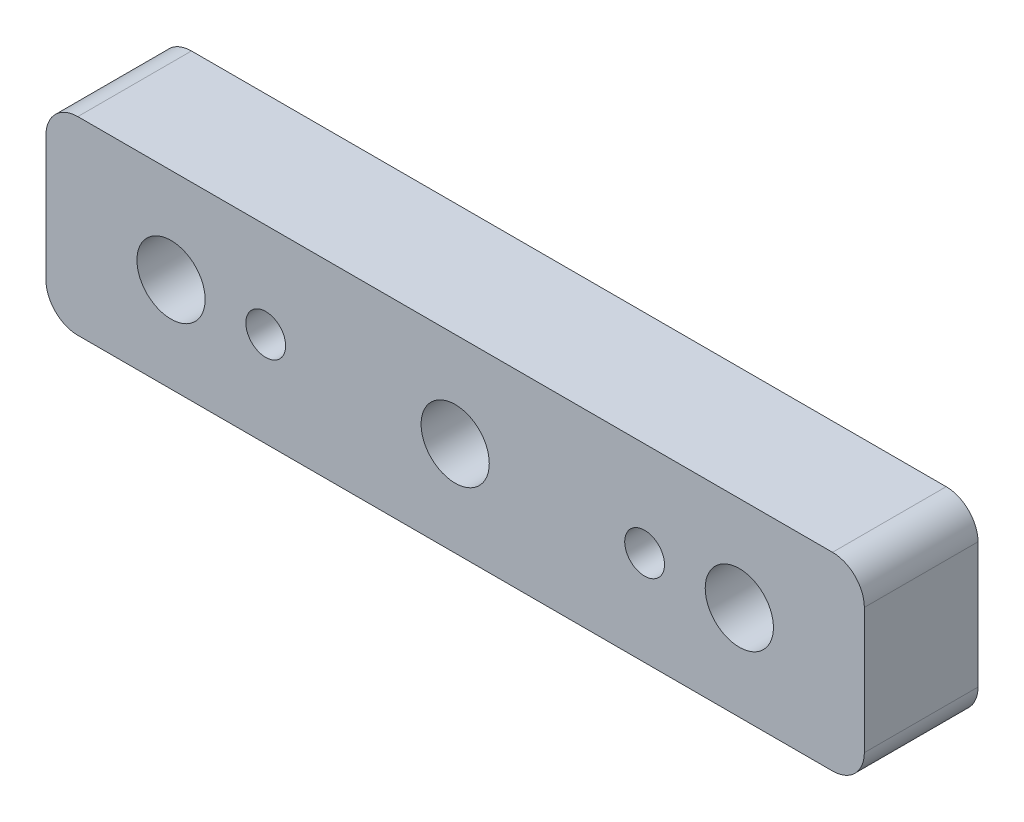
ISO-10303-21;
HEADER;
FILE_DESCRIPTION(('STEP AP214'),'2;1');
FILE_NAME('part.step','',(''),(''),'','','');
FILE_SCHEMA(('AUTOMOTIVE_DESIGN { 1 0 10303 214 1 1 1 1 }'));
ENDSEC;
DATA;
#1=APPLICATION_CONTEXT('core data for automotive mechanical design processes');
#2=APPLICATION_PROTOCOL_DEFINITION('international standard','automotive_design',2000,#1);
#3=PRODUCT_CONTEXT('',#1,'mechanical');
#4=PRODUCT('Part','Part','',(#3));
#5=PRODUCT_RELATED_PRODUCT_CATEGORY('part','',(#4));
#6=PRODUCT_DEFINITION_FORMATION('','',#4);
#7=PRODUCT_DEFINITION_CONTEXT('part definition',#1,'design');
#8=PRODUCT_DEFINITION('design','',#6,#7);
#9=PRODUCT_DEFINITION_SHAPE('','',#8);
#10=(LENGTH_UNIT() NAMED_UNIT(*) SI_UNIT(.MILLI.,.METRE.));
#11=(NAMED_UNIT(*) PLANE_ANGLE_UNIT() SI_UNIT($,.RADIAN.));
#12=(NAMED_UNIT(*) SI_UNIT($,.STERADIAN.) SOLID_ANGLE_UNIT());
#13=UNCERTAINTY_MEASURE_WITH_UNIT(LENGTH_MEASURE(1.E-05),#10,'distance_accuracy_value','');
#14=(GEOMETRIC_REPRESENTATION_CONTEXT(3) GLOBAL_UNCERTAINTY_ASSIGNED_CONTEXT((#13)) GLOBAL_UNIT_ASSIGNED_CONTEXT((#10,
#11,#12)) REPRESENTATION_CONTEXT('',''));
#15=CARTESIAN_POINT('',(0.,0.,0.));
#16=DIRECTION('',(0.,0.,1.));
#17=DIRECTION('',(1.,0.,0.));
#18=AXIS2_PLACEMENT_3D('',#15,#16,#17);
#19=CARTESIAN_POINT('',(39.84,6.64000000000001,12.));
#20=DIRECTION('',(0.,0.,-1.));
#21=DIRECTION('',(-1.,0.,0.));
#22=AXIS2_PLACEMENT_3D('',#19,#20,#21);
#23=CYLINDRICAL_SURFACE('',#22,3.36);
#24=CARTESIAN_POINT('',(39.84,6.64000000000001,0.));
#25=DIRECTION('',(0.,0.,1.));
#26=DIRECTION('',(1.,0.,0.));
#27=AXIS2_PLACEMENT_3D('',#24,#25,#26);
#28=CIRCLE('',#27,3.36);
#29=CARTESIAN_POINT('',(43.2,6.64000000000001,0.));
#30=VERTEX_POINT('',#29);
#31=CARTESIAN_POINT('',(39.84,10.,0.));
#32=VERTEX_POINT('',#31);
#33=EDGE_CURVE('E131',#30,#32,#28,.T.);
#34=ORIENTED_EDGE('',*,*,#33,.T.);
#35=DIRECTION('',(0.,0.,-1.));
#36=VECTOR('',#35,1.);
#37=CARTESIAN_POINT('',(39.84,10.,12.));
#38=LINE('',#37,#36);
#39=CARTESIAN_POINT('',(39.84,10.,12.));
#40=VERTEX_POINT('',#39);
#41=EDGE_CURVE('E11',#40,#32,#38,.T.);
#42=ORIENTED_EDGE('',*,*,#41,.F.);
#43=CARTESIAN_POINT('',(39.84,6.64000000000001,12.));
#44=DIRECTION('',(0.,0.,1.));
#45=DIRECTION('',(1.,0.,0.));
#46=AXIS2_PLACEMENT_3D('',#43,#44,#45);
#47=CIRCLE('',#46,3.36);
#48=CARTESIAN_POINT('',(43.2,6.64000000000001,12.));
#49=VERTEX_POINT('',#48);
#50=EDGE_CURVE('E146',#49,#40,#47,.T.);
#51=ORIENTED_EDGE('',*,*,#50,.F.);
#52=DIRECTION('',(0.,0.,-1.));
#53=VECTOR('',#52,1.);
#54=CARTESIAN_POINT('',(43.2,6.64000000000001,12.));
#55=LINE('',#54,#53);
#56=EDGE_CURVE('E127',#49,#30,#55,.T.);
#57=ORIENTED_EDGE('',*,*,#56,.T.);
#58=EDGE_LOOP('',(#34,#42,#51,#57));
#59=FACE_BOUND('',#58,.T.);
#60=ADVANCED_FACE('F35',(#59),#23,.T.);
#61=CARTESIAN_POINT('',(39.84,10.,12.));
#62=DIRECTION('',(0.,-1.,0.));
#63=DIRECTION('',(1.,0.,0.));
#64=AXIS2_PLACEMENT_3D('',#61,#62,#63);
#65=PLANE('',#64);
#66=DIRECTION('',(-1.,0.,0.));
#67=VECTOR('',#66,1.);
#68=CARTESIAN_POINT('',(39.84,10.,0.));
#69=LINE('',#68,#67);
#70=CARTESIAN_POINT('',(-39.84,9.99999999999999,0.));
#71=VERTEX_POINT('',#70);
#72=EDGE_CURVE('E134',#32,#71,#69,.T.);
#73=ORIENTED_EDGE('',*,*,#72,.T.);
#74=DIRECTION('',(0.,0.,-1.));
#75=VECTOR('',#74,1.);
#76=CARTESIAN_POINT('',(-39.84,9.99999999999999,12.));
#77=LINE('',#76,#75);
#78=CARTESIAN_POINT('',(-39.84,9.99999999999999,12.));
#79=VERTEX_POINT('',#78);
#80=EDGE_CURVE('E43',#79,#71,#77,.T.);
#81=ORIENTED_EDGE('',*,*,#80,.F.);
#82=DIRECTION('',(-1.,0.,0.));
#83=VECTOR('',#82,1.);
#84=CARTESIAN_POINT('',(39.84,10.,12.));
#85=LINE('',#84,#83);
#86=EDGE_CURVE('E94',#40,#79,#85,.T.);
#87=ORIENTED_EDGE('',*,*,#86,.F.);
#88=ORIENTED_EDGE('',*,*,#41,.T.);
#89=EDGE_LOOP('',(#73,#81,#87,#88));
#90=FACE_BOUND('',#89,.T.);
#91=ADVANCED_FACE('F239',(#90),#65,.F.);
#92=CARTESIAN_POINT('',(-39.84,6.64,12.));
#93=DIRECTION('',(0.,0.,-1.));
#94=DIRECTION('',(-1.,0.,0.));
#95=AXIS2_PLACEMENT_3D('',#92,#93,#94);
#96=CYLINDRICAL_SURFACE('',#95,3.36);
#97=CARTESIAN_POINT('',(-39.84,6.64,0.));
#98=DIRECTION('',(0.,0.,1.));
#99=DIRECTION('',(1.,0.,0.));
#100=AXIS2_PLACEMENT_3D('',#97,#98,#99);
#101=CIRCLE('',#100,3.36);
#102=CARTESIAN_POINT('',(-43.2,6.64,0.));
#103=VERTEX_POINT('',#102);
#104=EDGE_CURVE('E137',#71,#103,#101,.T.);
#105=ORIENTED_EDGE('',*,*,#104,.T.);
#106=DIRECTION('',(0.,0.,-1.));
#107=VECTOR('',#106,1.);
#108=CARTESIAN_POINT('',(-43.2,6.64,12.));
#109=LINE('',#108,#107);
#110=CARTESIAN_POINT('',(-43.2,6.64,12.));
#111=VERTEX_POINT('',#110);
#112=EDGE_CURVE('E153',#111,#103,#109,.T.);
#113=ORIENTED_EDGE('',*,*,#112,.F.);
#114=CARTESIAN_POINT('',(-39.84,6.64,12.));
#115=DIRECTION('',(0.,0.,1.));
#116=DIRECTION('',(1.,0.,0.));
#117=AXIS2_PLACEMENT_3D('',#114,#115,#116);
#118=CIRCLE('',#117,3.36);
#119=EDGE_CURVE('E161',#79,#111,#118,.T.);
#120=ORIENTED_EDGE('',*,*,#119,.F.);
#121=ORIENTED_EDGE('',*,*,#80,.T.);
#122=EDGE_LOOP('',(#105,#113,#120,#121));
#123=FACE_BOUND('',#122,.T.);
#124=ADVANCED_FACE('F159',(#123),#96,.T.);
#125=CARTESIAN_POINT('',(-43.2,-6.64,12.));
#126=DIRECTION('',(1.,0.,0.));
#127=DIRECTION('',(0.,0.,-1.));
#128=AXIS2_PLACEMENT_3D('',#125,#126,#127);
#129=PLANE('',#128);
#130=DIRECTION('',(0.,-1.,0.));
#131=VECTOR('',#130,1.);
#132=CARTESIAN_POINT('',(-43.2,-6.64,0.));
#133=LINE('',#132,#131);
#134=CARTESIAN_POINT('',(-43.2,-6.64,0.));
#135=VERTEX_POINT('',#134);
#136=EDGE_CURVE('E139',#103,#135,#133,.T.);
#137=ORIENTED_EDGE('',*,*,#136,.T.);
#138=DIRECTION('',(0.,0.,-1.));
#139=VECTOR('',#138,1.);
#140=CARTESIAN_POINT('',(-43.2,-6.64,12.));
#141=LINE('',#140,#139);
#142=CARTESIAN_POINT('',(-43.2,-6.64,12.));
#143=VERTEX_POINT('',#142);
#144=EDGE_CURVE('E150',#143,#135,#141,.T.);
#145=ORIENTED_EDGE('',*,*,#144,.F.);
#146=DIRECTION('',(0.,-1.,0.));
#147=VECTOR('',#146,1.);
#148=CARTESIAN_POINT('',(-43.2,-6.64,12.));
#149=LINE('',#148,#147);
#150=EDGE_CURVE('E173',#111,#143,#149,.T.);
#151=ORIENTED_EDGE('',*,*,#150,.F.);
#152=ORIENTED_EDGE('',*,*,#112,.T.);
#153=EDGE_LOOP('',(#137,#145,#151,#152));
#154=FACE_BOUND('',#153,.T.);
#155=ADVANCED_FACE('F169',(#154),#129,.F.);
#156=CARTESIAN_POINT('',(-39.84,-6.64,12.));
#157=DIRECTION('',(0.,0.,-1.));
#158=DIRECTION('',(-1.,0.,0.));
#159=AXIS2_PLACEMENT_3D('',#156,#157,#158);
#160=CYLINDRICAL_SURFACE('',#159,3.36);
#161=CARTESIAN_POINT('',(-39.84,-6.64,0.));
#162=DIRECTION('',(0.,0.,1.));
#163=DIRECTION('',(-1.,0.,0.));
#164=AXIS2_PLACEMENT_3D('',#161,#162,#163);
#165=CIRCLE('',#164,3.36);
#166=CARTESIAN_POINT('',(-39.84,-10.,0.));
#167=VERTEX_POINT('',#166);
#168=EDGE_CURVE('E141',#135,#167,#165,.T.);
#169=ORIENTED_EDGE('',*,*,#168,.T.);
#170=DIRECTION('',(0.,0.,-1.));
#171=VECTOR('',#170,1.);
#172=CARTESIAN_POINT('',(-39.84,-10.,12.));
#173=LINE('',#172,#171);
#174=CARTESIAN_POINT('',(-39.84,-10.,12.));
#175=VERTEX_POINT('',#174);
#176=EDGE_CURVE('E122',#175,#167,#173,.T.);
#177=ORIENTED_EDGE('',*,*,#176,.F.);
#178=CARTESIAN_POINT('',(-39.84,-6.64,12.));
#179=DIRECTION('',(0.,0.,1.));
#180=DIRECTION('',(-1.,0.,0.));
#181=AXIS2_PLACEMENT_3D('',#178,#179,#180);
#182=CIRCLE('',#181,3.36);
#183=EDGE_CURVE('E113',#143,#175,#182,.T.);
#184=ORIENTED_EDGE('',*,*,#183,.F.);
#185=ORIENTED_EDGE('',*,*,#144,.T.);
#186=EDGE_LOOP('',(#169,#177,#184,#185));
#187=FACE_BOUND('',#186,.T.);
#188=ADVANCED_FACE('F172',(#187),#160,.T.);
#189=CARTESIAN_POINT('',(39.84,-9.99999999999999,12.));
#190=DIRECTION('',(0.,1.,0.));
#191=DIRECTION('',(-1.,0.,0.));
#192=AXIS2_PLACEMENT_3D('',#189,#190,#191);
#193=PLANE('',#192);
#194=DIRECTION('',(1.,0.,0.));
#195=VECTOR('',#194,1.);
#196=CARTESIAN_POINT('',(39.84,-9.99999999999999,0.));
#197=LINE('',#196,#195);
#198=CARTESIAN_POINT('',(39.84,-9.99999999999999,0.));
#199=VERTEX_POINT('',#198);
#200=EDGE_CURVE('E121',#167,#199,#197,.T.);
#201=ORIENTED_EDGE('',*,*,#200,.T.);
#202=DIRECTION('',(0.,0.,-1.));
#203=VECTOR('',#202,1.);
#204=CARTESIAN_POINT('',(39.84,-9.99999999999999,12.));
#205=LINE('',#204,#203);
#206=CARTESIAN_POINT('',(39.84,-9.99999999999999,12.));
#207=VERTEX_POINT('',#206);
#208=EDGE_CURVE('E118',#207,#199,#205,.T.);
#209=ORIENTED_EDGE('',*,*,#208,.F.);
#210=DIRECTION('',(1.,0.,0.));
#211=VECTOR('',#210,1.);
#212=CARTESIAN_POINT('',(39.84,-9.99999999999999,12.));
#213=LINE('',#212,#211);
#214=EDGE_CURVE('E107',#175,#207,#213,.T.);
#215=ORIENTED_EDGE('',*,*,#214,.F.);
#216=ORIENTED_EDGE('',*,*,#176,.T.);
#217=EDGE_LOOP('',(#201,#209,#215,#216));
#218=FACE_BOUND('',#217,.T.);
#219=ADVANCED_FACE('F119',(#218),#193,.F.);
#220=CARTESIAN_POINT('',(39.84,-6.64,12.));
#221=DIRECTION('',(0.,0.,-1.));
#222=DIRECTION('',(-1.,0.,0.));
#223=AXIS2_PLACEMENT_3D('',#220,#221,#222);
#224=CYLINDRICAL_SURFACE('',#223,3.36);
#225=CARTESIAN_POINT('',(39.84,-6.64,0.));
#226=DIRECTION('',(0.,0.,1.));
#227=DIRECTION('',(1.,0.,0.));
#228=AXIS2_PLACEMENT_3D('',#225,#226,#227);
#229=CIRCLE('',#228,3.36);
#230=CARTESIAN_POINT('',(43.2,-6.64,0.));
#231=VERTEX_POINT('',#230);
#232=EDGE_CURVE('E80',#199,#231,#229,.T.);
#233=ORIENTED_EDGE('',*,*,#232,.T.);
#234=DIRECTION('',(0.,0.,-1.));
#235=VECTOR('',#234,1.);
#236=CARTESIAN_POINT('',(43.2,-6.64,12.));
#237=LINE('',#236,#235);
#238=CARTESIAN_POINT('',(43.2,-6.64,12.));
#239=VERTEX_POINT('',#238);
#240=EDGE_CURVE('E123',#239,#231,#237,.T.);
#241=ORIENTED_EDGE('',*,*,#240,.F.);
#242=CARTESIAN_POINT('',(39.84,-6.64,12.));
#243=DIRECTION('',(0.,0.,1.));
#244=DIRECTION('',(1.,0.,0.));
#245=AXIS2_PLACEMENT_3D('',#242,#243,#244);
#246=CIRCLE('',#245,3.36);
#247=EDGE_CURVE('E111',#207,#239,#246,.T.);
#248=ORIENTED_EDGE('',*,*,#247,.F.);
#249=ORIENTED_EDGE('',*,*,#208,.T.);
#250=EDGE_LOOP('',(#233,#241,#248,#249));
#251=FACE_BOUND('',#250,.T.);
#252=ADVANCED_FACE('F125',(#251),#224,.T.);
#253=CARTESIAN_POINT('',(43.2,-6.64,12.));
#254=DIRECTION('',(-1.,0.,0.));
#255=DIRECTION('',(0.,0.,1.));
#256=AXIS2_PLACEMENT_3D('',#253,#254,#255);
#257=PLANE('',#256);
#258=DIRECTION('',(0.,1.,0.));
#259=VECTOR('',#258,1.);
#260=CARTESIAN_POINT('',(43.2,-6.64,0.));
#261=LINE('',#260,#259);
#262=EDGE_CURVE('E86',#231,#30,#261,.T.);
#263=ORIENTED_EDGE('',*,*,#262,.T.);
#264=ORIENTED_EDGE('',*,*,#56,.F.);
#265=DIRECTION('',(0.,1.,0.));
#266=VECTOR('',#265,1.);
#267=CARTESIAN_POINT('',(43.2,-6.64,12.));
#268=LINE('',#267,#266);
#269=EDGE_CURVE('E51',#239,#49,#268,.T.);
#270=ORIENTED_EDGE('',*,*,#269,.F.);
#271=ORIENTED_EDGE('',*,*,#240,.T.);
#272=EDGE_LOOP('',(#263,#264,#270,#271));
#273=FACE_BOUND('',#272,.T.);
#274=ADVANCED_FACE('F213',(#273),#257,.F.);
#275=CARTESIAN_POINT('',(39.84,6.64000000000001,12.));
#276=DIRECTION('',(0.,0.,1.));
#277=DIRECTION('',(1.,0.,0.));
#278=AXIS2_PLACEMENT_3D('',#275,#276,#277);
#279=PLANE('',#278);
#280=CARTESIAN_POINT('',(-20.,0.,12.));
#281=DIRECTION('',(0.,0.,1.));
#282=DIRECTION('',(1.,0.,0.));
#283=AXIS2_PLACEMENT_3D('',#280,#281,#282);
#284=CIRCLE('',#283,2.09999999999999);
#285=CARTESIAN_POINT('',(-17.9,0.,12.));
#286=VERTEX_POINT('',#285);
#287=EDGE_CURVE('E205',#286,#286,#284,.T.);
#288=ORIENTED_EDGE('',*,*,#287,.F.);
#289=EDGE_LOOP('',(#288));
#290=FACE_BOUND('',#289,.T.);
#291=CARTESIAN_POINT('',(20.,0.,12.));
#292=DIRECTION('',(0.,0.,1.));
#293=DIRECTION('',(1.,0.,0.));
#294=AXIS2_PLACEMENT_3D('',#291,#292,#293);
#295=CIRCLE('',#294,2.09999999999999);
#296=CARTESIAN_POINT('',(22.1,0.,12.));
#297=VERTEX_POINT('',#296);
#298=EDGE_CURVE('E199',#297,#297,#295,.T.);
#299=ORIENTED_EDGE('',*,*,#298,.F.);
#300=EDGE_LOOP('',(#299));
#301=FACE_BOUND('',#300,.T.);
#302=CARTESIAN_POINT('',(30.,0.,12.));
#303=DIRECTION('',(0.,0.,1.));
#304=DIRECTION('',(-1.,0.,0.));
#305=AXIS2_PLACEMENT_3D('',#302,#303,#304);
#306=CIRCLE('',#305,3.6);
#307=CARTESIAN_POINT('',(26.4,0.,12.));
#308=VERTEX_POINT('',#307);
#309=EDGE_CURVE('E191',#308,#308,#306,.T.);
#310=ORIENTED_EDGE('',*,*,#309,.F.);
#311=EDGE_LOOP('',(#310));
#312=FACE_BOUND('',#311,.T.);
#313=CARTESIAN_POINT('',(-30.,0.,12.));
#314=DIRECTION('',(0.,0.,1.));
#315=DIRECTION('',(1.,0.,0.));
#316=AXIS2_PLACEMENT_3D('',#313,#314,#315);
#317=CIRCLE('',#316,3.6);
#318=CARTESIAN_POINT('',(-26.4,0.,12.));
#319=VERTEX_POINT('',#318);
#320=EDGE_CURVE('E185',#319,#319,#317,.T.);
#321=ORIENTED_EDGE('',*,*,#320,.F.);
#322=EDGE_LOOP('',(#321));
#323=FACE_BOUND('',#322,.T.);
#324=CARTESIAN_POINT('',(0.,0.,12.));
#325=DIRECTION('',(0.,0.,1.));
#326=DIRECTION('',(1.,0.,0.));
#327=AXIS2_PLACEMENT_3D('',#324,#325,#326);
#328=CIRCLE('',#327,3.6);
#329=CARTESIAN_POINT('',(3.6,0.,12.));
#330=VERTEX_POINT('',#329);
#331=EDGE_CURVE('E179',#330,#330,#328,.T.);
#332=ORIENTED_EDGE('',*,*,#331,.F.);
#333=EDGE_LOOP('',(#332));
#334=FACE_BOUND('',#333,.T.);
#335=ORIENTED_EDGE('',*,*,#50,.T.);
#336=ORIENTED_EDGE('',*,*,#86,.T.);
#337=ORIENTED_EDGE('',*,*,#119,.T.);
#338=ORIENTED_EDGE('',*,*,#150,.T.);
#339=ORIENTED_EDGE('',*,*,#183,.T.);
#340=ORIENTED_EDGE('',*,*,#214,.T.);
#341=ORIENTED_EDGE('',*,*,#247,.T.);
#342=ORIENTED_EDGE('',*,*,#269,.T.);
#343=EDGE_LOOP('',(#335,#336,#337,#338,#339,#340,#341,#342));
#344=FACE_BOUND('',#343,.T.);
#345=ADVANCED_FACE('F109',(#290,#301,#312,#323,#334,#344),#279,.T.);
#346=CARTESIAN_POINT('',(39.84,6.64000000000001,0.));
#347=DIRECTION('',(0.,0.,1.));
#348=DIRECTION('',(1.,0.,0.));
#349=AXIS2_PLACEMENT_3D('',#346,#347,#348);
#350=PLANE('',#349);
#351=CARTESIAN_POINT('',(-20.,0.,0.));
#352=DIRECTION('',(0.,0.,1.));
#353=DIRECTION('',(1.,0.,0.));
#354=AXIS2_PLACEMENT_3D('',#351,#352,#353);
#355=CIRCLE('',#354,2.1);
#356=CARTESIAN_POINT('',(-17.9,0.,0.));
#357=VERTEX_POINT('',#356);
#358=EDGE_CURVE('E202',#357,#357,#355,.T.);
#359=ORIENTED_EDGE('',*,*,#358,.T.);
#360=EDGE_LOOP('',(#359));
#361=FACE_BOUND('',#360,.T.);
#362=CARTESIAN_POINT('',(20.,0.,0.));
#363=DIRECTION('',(0.,0.,1.));
#364=DIRECTION('',(1.,0.,0.));
#365=AXIS2_PLACEMENT_3D('',#362,#363,#364);
#366=CIRCLE('',#365,2.1);
#367=CARTESIAN_POINT('',(22.1,0.,0.));
#368=VERTEX_POINT('',#367);
#369=EDGE_CURVE('E194',#368,#368,#366,.T.);
#370=ORIENTED_EDGE('',*,*,#369,.T.);
#371=EDGE_LOOP('',(#370));
#372=FACE_BOUND('',#371,.T.);
#373=CARTESIAN_POINT('',(30.,0.,0.));
#374=DIRECTION('',(0.,0.,1.));
#375=DIRECTION('',(-1.,0.,0.));
#376=AXIS2_PLACEMENT_3D('',#373,#374,#375);
#377=CIRCLE('',#376,3.6);
#378=CARTESIAN_POINT('',(26.4,0.,0.));
#379=VERTEX_POINT('',#378);
#380=EDGE_CURVE('E188',#379,#379,#377,.T.);
#381=ORIENTED_EDGE('',*,*,#380,.T.);
#382=EDGE_LOOP('',(#381));
#383=FACE_BOUND('',#382,.T.);
#384=CARTESIAN_POINT('',(-30.,0.,0.));
#385=DIRECTION('',(0.,0.,1.));
#386=DIRECTION('',(1.,0.,0.));
#387=AXIS2_PLACEMENT_3D('',#384,#385,#386);
#388=CIRCLE('',#387,3.6);
#389=CARTESIAN_POINT('',(-26.4,0.,0.));
#390=VERTEX_POINT('',#389);
#391=EDGE_CURVE('E182',#390,#390,#388,.T.);
#392=ORIENTED_EDGE('',*,*,#391,.T.);
#393=EDGE_LOOP('',(#392));
#394=FACE_BOUND('',#393,.T.);
#395=CARTESIAN_POINT('',(0.,0.,0.));
#396=DIRECTION('',(0.,0.,1.));
#397=DIRECTION('',(1.,0.,0.));
#398=AXIS2_PLACEMENT_3D('',#395,#396,#397);
#399=CIRCLE('',#398,3.6);
#400=CARTESIAN_POINT('',(3.6,0.,0.));
#401=VERTEX_POINT('',#400);
#402=EDGE_CURVE('E135',#401,#401,#399,.T.);
#403=ORIENTED_EDGE('',*,*,#402,.T.);
#404=EDGE_LOOP('',(#403));
#405=FACE_BOUND('',#404,.T.);
#406=ORIENTED_EDGE('',*,*,#33,.F.);
#407=ORIENTED_EDGE('',*,*,#262,.F.);
#408=ORIENTED_EDGE('',*,*,#232,.F.);
#409=ORIENTED_EDGE('',*,*,#200,.F.);
#410=ORIENTED_EDGE('',*,*,#168,.F.);
#411=ORIENTED_EDGE('',*,*,#136,.F.);
#412=ORIENTED_EDGE('',*,*,#104,.F.);
#413=ORIENTED_EDGE('',*,*,#72,.F.);
#414=EDGE_LOOP('',(#406,#407,#408,#409,#410,#411,#412,#413));
#415=FACE_BOUND('',#414,.T.);
#416=ADVANCED_FACE('F165',(#361,#372,#383,#394,#405,#415),#350,.F.);
#417=CARTESIAN_POINT('',(0.,0.,0.));
#418=DIRECTION('',(0.,0.,1.));
#419=DIRECTION('',(1.,0.,0.));
#420=AXIS2_PLACEMENT_3D('',#417,#418,#419);
#421=CYLINDRICAL_SURFACE('',#420,3.6);
#422=ORIENTED_EDGE('',*,*,#402,.F.);
#423=EDGE_LOOP('',(#422));
#424=FACE_BOUND('',#423,.T.);
#425=ORIENTED_EDGE('',*,*,#331,.T.);
#426=EDGE_LOOP('',(#425));
#427=FACE_BOUND('',#426,.T.);
#428=ADVANCED_FACE('F223',(#424,#427),#421,.F.);
#429=CARTESIAN_POINT('',(-30.,0.,0.));
#430=DIRECTION('',(0.,0.,1.));
#431=DIRECTION('',(1.,0.,0.));
#432=AXIS2_PLACEMENT_3D('',#429,#430,#431);
#433=CYLINDRICAL_SURFACE('',#432,3.6);
#434=ORIENTED_EDGE('',*,*,#391,.F.);
#435=EDGE_LOOP('',(#434));
#436=FACE_BOUND('',#435,.T.);
#437=ORIENTED_EDGE('',*,*,#320,.T.);
#438=EDGE_LOOP('',(#437));
#439=FACE_BOUND('',#438,.T.);
#440=ADVANCED_FACE('F225',(#436,#439),#433,.F.);
#441=CARTESIAN_POINT('',(30.,0.,0.));
#442=DIRECTION('',(0.,0.,1.));
#443=DIRECTION('',(1.,0.,0.));
#444=AXIS2_PLACEMENT_3D('',#441,#442,#443);
#445=CYLINDRICAL_SURFACE('',#444,3.6);
#446=ORIENTED_EDGE('',*,*,#380,.F.);
#447=EDGE_LOOP('',(#446));
#448=FACE_BOUND('',#447,.T.);
#449=ORIENTED_EDGE('',*,*,#309,.T.);
#450=EDGE_LOOP('',(#449));
#451=FACE_BOUND('',#450,.T.);
#452=ADVANCED_FACE('F232',(#448,#451),#445,.F.);
#453=CARTESIAN_POINT('',(20.,0.,12.));
#454=DIRECTION('',(0.,0.,1.));
#455=DIRECTION('',(1.,0.,0.));
#456=AXIS2_PLACEMENT_3D('',#453,#454,#455);
#457=CYLINDRICAL_SURFACE('',#456,2.09999999999999);
#458=ORIENTED_EDGE('',*,*,#369,.F.);
#459=EDGE_LOOP('',(#458));
#460=FACE_BOUND('',#459,.T.);
#461=ORIENTED_EDGE('',*,*,#298,.T.);
#462=EDGE_LOOP('',(#461));
#463=FACE_BOUND('',#462,.T.);
#464=ADVANCED_FACE('F305',(#460,#463),#457,.F.);
#465=CARTESIAN_POINT('',(-20.,0.,12.));
#466=DIRECTION('',(0.,0.,1.));
#467=DIRECTION('',(1.,0.,0.));
#468=AXIS2_PLACEMENT_3D('',#465,#466,#467);
#469=CYLINDRICAL_SURFACE('',#468,2.09999999999999);
#470=ORIENTED_EDGE('',*,*,#358,.F.);
#471=EDGE_LOOP('',(#470));
#472=FACE_BOUND('',#471,.T.);
#473=ORIENTED_EDGE('',*,*,#287,.T.);
#474=EDGE_LOOP('',(#473));
#475=FACE_BOUND('',#474,.T.);
#476=ADVANCED_FACE('F209',(#472,#475),#469,.F.);
#477=CLOSED_SHELL('',(#60,#91,#124,#155,#188,#219,#252,#274,#345,#416,#428,#440,#452,#464,#476));
#478=MANIFOLD_SOLID_BREP('B2',#477);
#479=ADVANCED_BREP_SHAPE_REPRESENTATION('',(#18,#478),#14);
#480=SHAPE_DEFINITION_REPRESENTATION(#9,#479);
ENDSEC;
END-ISO-10303-21;
